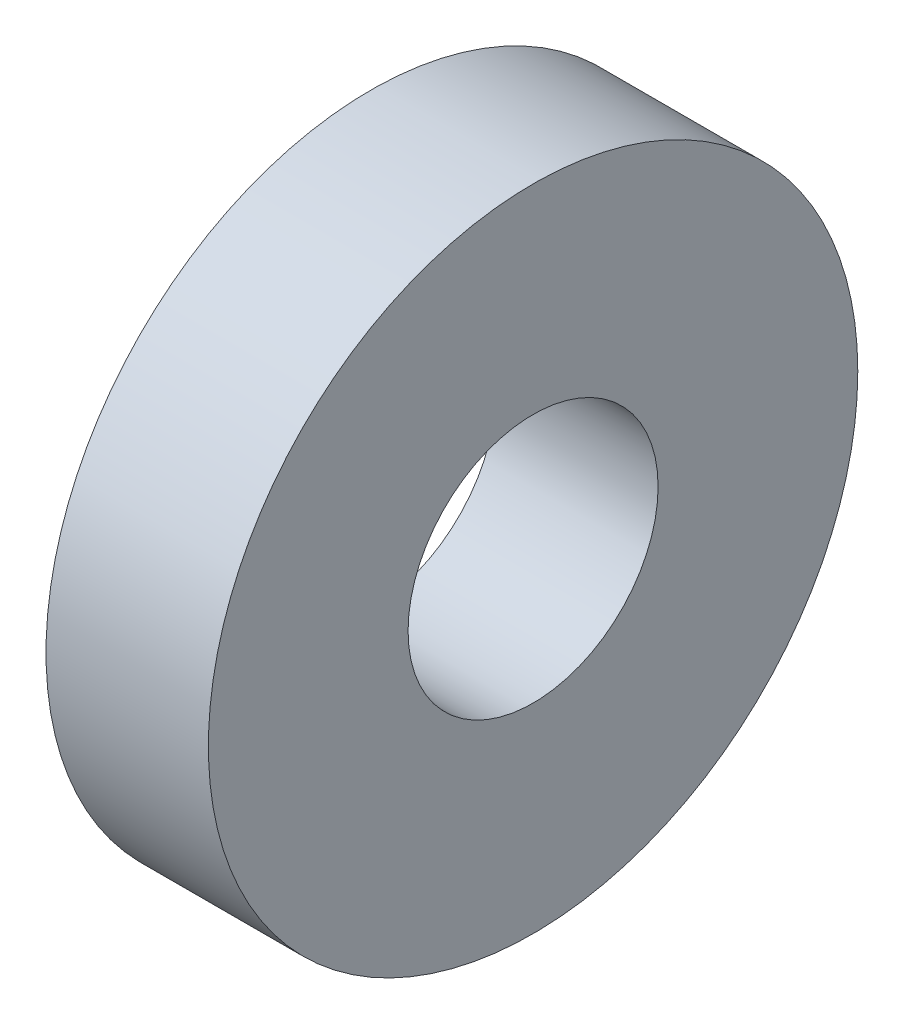
ISO-10303-21;
HEADER;
FILE_DESCRIPTION(('STEP AP214'),'2;1');
FILE_NAME('part.step','',(''),(''),'','','');
FILE_SCHEMA(('AUTOMOTIVE_DESIGN { 1 0 10303 214 1 1 1 1 }'));
ENDSEC;
DATA;
#1=APPLICATION_CONTEXT('core data for automotive mechanical design processes');
#2=APPLICATION_PROTOCOL_DEFINITION('international standard','automotive_design',2000,#1);
#3=PRODUCT_CONTEXT('',#1,'mechanical');
#4=PRODUCT('Part','Part','',(#3));
#5=PRODUCT_RELATED_PRODUCT_CATEGORY('part','',(#4));
#6=PRODUCT_DEFINITION_FORMATION('','',#4);
#7=PRODUCT_DEFINITION_CONTEXT('part definition',#1,'design');
#8=PRODUCT_DEFINITION('design','',#6,#7);
#9=PRODUCT_DEFINITION_SHAPE('','',#8);
#10=(LENGTH_UNIT() NAMED_UNIT(*) SI_UNIT(.MILLI.,.METRE.));
#11=(NAMED_UNIT(*) PLANE_ANGLE_UNIT() SI_UNIT($,.RADIAN.));
#12=(NAMED_UNIT(*) SI_UNIT($,.STERADIAN.) SOLID_ANGLE_UNIT());
#13=UNCERTAINTY_MEASURE_WITH_UNIT(LENGTH_MEASURE(1.E-05),#10,'distance_accuracy_value','');
#14=(GEOMETRIC_REPRESENTATION_CONTEXT(3) GLOBAL_UNCERTAINTY_ASSIGNED_CONTEXT((#13)) GLOBAL_UNIT_ASSIGNED_CONTEXT((#10,
#11,#12)) REPRESENTATION_CONTEXT('',''));
#15=CARTESIAN_POINT('',(0.,0.,0.));
#16=DIRECTION('',(0.,0.,1.));
#17=DIRECTION('',(1.,0.,0.));
#18=AXIS2_PLACEMENT_3D('',#15,#16,#17);
#19=CARTESIAN_POINT('',(6.35,0.,0.));
#20=DIRECTION('',(1.,0.,0.));
#21=DIRECTION('',(0.,0.,-1.));
#22=AXIS2_PLACEMENT_3D('',#19,#20,#21);
#23=PLANE('',#22);
#24=CARTESIAN_POINT('',(6.35,0.,0.));
#25=DIRECTION('',(1.,0.,0.));
#26=DIRECTION('',(0.,0.,-1.));
#27=AXIS2_PLACEMENT_3D('',#24,#25,#26);
#28=CIRCLE('',#27,12.7);
#29=CARTESIAN_POINT('',(6.35,0.,-12.7));
#30=VERTEX_POINT('',#29);
#31=EDGE_CURVE('E10',#30,#30,#28,.T.);
#32=ORIENTED_EDGE('',*,*,#31,.T.);
#33=EDGE_LOOP('',(#32));
#34=FACE_BOUND('',#33,.T.);
#35=CARTESIAN_POINT('',(6.35,0.,0.));
#36=DIRECTION('',(1.,0.,0.));
#37=DIRECTION('',(0.,0.,-1.));
#38=AXIS2_PLACEMENT_3D('',#35,#36,#37);
#39=CIRCLE('',#38,4.8895);
#40=CARTESIAN_POINT('',(6.35,0.,-4.8895));
#41=VERTEX_POINT('',#40);
#42=EDGE_CURVE('E42',#41,#41,#39,.T.);
#43=ORIENTED_EDGE('',*,*,#42,.F.);
#44=EDGE_LOOP('',(#43));
#45=FACE_BOUND('',#44,.T.);
#46=ADVANCED_FACE('F31',(#34,#45),#23,.T.);
#47=CARTESIAN_POINT('',(0.,0.,0.));
#48=DIRECTION('',(1.,0.,0.));
#49=DIRECTION('',(0.,0.,-1.));
#50=AXIS2_PLACEMENT_3D('',#47,#48,#49);
#51=PLANE('',#50);
#52=CARTESIAN_POINT('',(0.,0.,0.));
#53=DIRECTION('',(1.,0.,0.));
#54=DIRECTION('',(0.,0.,-1.));
#55=AXIS2_PLACEMENT_3D('',#52,#53,#54);
#56=CIRCLE('',#55,12.7);
#57=CARTESIAN_POINT('',(0.,0.,-12.7));
#58=VERTEX_POINT('',#57);
#59=EDGE_CURVE('E35',#58,#58,#56,.T.);
#60=ORIENTED_EDGE('',*,*,#59,.F.);
#61=EDGE_LOOP('',(#60));
#62=FACE_BOUND('',#61,.T.);
#63=CARTESIAN_POINT('',(0.,0.,0.));
#64=DIRECTION('',(1.,0.,0.));
#65=DIRECTION('',(0.,0.,-1.));
#66=AXIS2_PLACEMENT_3D('',#63,#64,#65);
#67=CIRCLE('',#66,4.8895);
#68=CARTESIAN_POINT('',(0.,0.,-4.8895));
#69=VERTEX_POINT('',#68);
#70=EDGE_CURVE('E44',#69,#69,#67,.T.);
#71=ORIENTED_EDGE('',*,*,#70,.T.);
#72=EDGE_LOOP('',(#71));
#73=FACE_BOUND('',#72,.T.);
#74=ADVANCED_FACE('F54',(#62,#73),#51,.F.);
#75=CARTESIAN_POINT('',(6.35,0.,0.));
#76=DIRECTION('',(-1.,0.,0.));
#77=DIRECTION('',(0.,0.,1.));
#78=AXIS2_PLACEMENT_3D('',#75,#76,#77);
#79=CYLINDRICAL_SURFACE('',#78,12.7);
#80=ORIENTED_EDGE('',*,*,#31,.F.);
#81=EDGE_LOOP('',(#80));
#82=FACE_BOUND('',#81,.T.);
#83=ORIENTED_EDGE('',*,*,#59,.T.);
#84=EDGE_LOOP('',(#83));
#85=FACE_BOUND('',#84,.T.);
#86=ADVANCED_FACE('F33',(#82,#85),#79,.T.);
#87=CARTESIAN_POINT('',(6.35,0.,0.));
#88=DIRECTION('',(-1.,0.,0.));
#89=DIRECTION('',(0.,0.,1.));
#90=AXIS2_PLACEMENT_3D('',#87,#88,#89);
#91=CYLINDRICAL_SURFACE('',#90,4.8895);
#92=ORIENTED_EDGE('',*,*,#42,.T.);
#93=EDGE_LOOP('',(#92));
#94=FACE_BOUND('',#93,.T.);
#95=ORIENTED_EDGE('',*,*,#70,.F.);
#96=EDGE_LOOP('',(#95));
#97=FACE_BOUND('',#96,.T.);
#98=ADVANCED_FACE('F50',(#94,#97),#91,.F.);
#99=CLOSED_SHELL('',(#46,#74,#86,#98));
#100=MANIFOLD_SOLID_BREP('B2',#99);
#101=ADVANCED_BREP_SHAPE_REPRESENTATION('',(#18,#100),#14);
#102=SHAPE_DEFINITION_REPRESENTATION(#9,#101);
ENDSEC;
END-ISO-10303-21;
